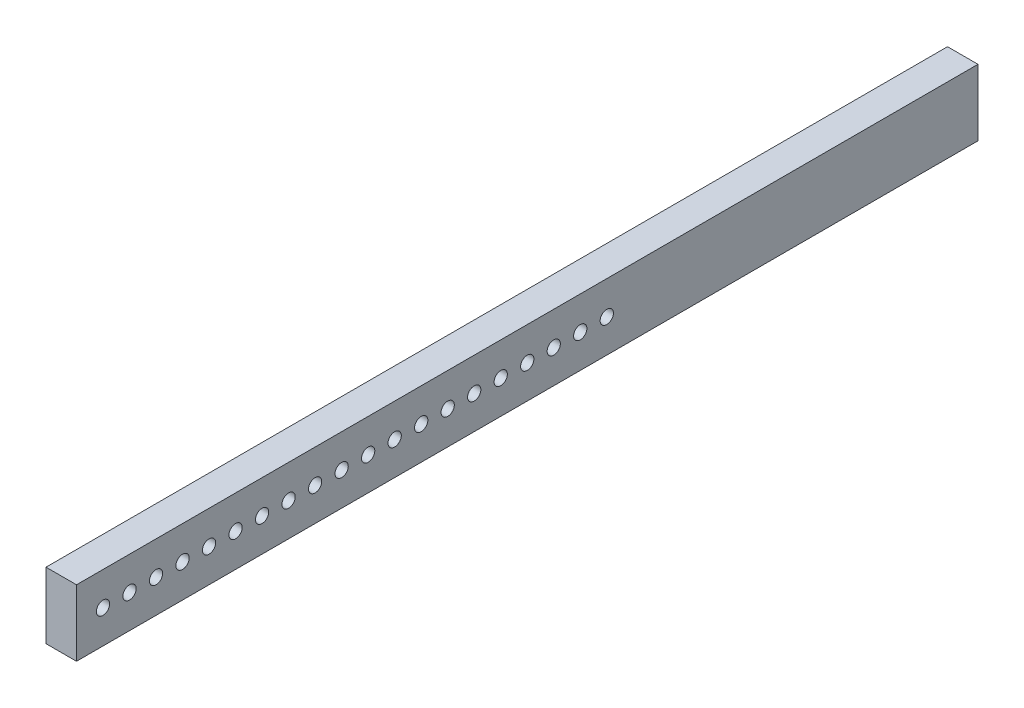
ISO-10303-21;
HEADER;
FILE_DESCRIPTION(('STEP AP214'),'2;1');
FILE_NAME('part.step','',(''),(''),'','','');
FILE_SCHEMA(('AUTOMOTIVE_DESIGN { 1 0 10303 214 1 1 1 1 }'));
ENDSEC;
DATA;
#1=APPLICATION_CONTEXT('core data for automotive mechanical design processes');
#2=APPLICATION_PROTOCOL_DEFINITION('international standard','automotive_design',2000,#1);
#3=PRODUCT_CONTEXT('',#1,'mechanical');
#4=PRODUCT('Part','Part','',(#3));
#5=PRODUCT_RELATED_PRODUCT_CATEGORY('part','',(#4));
#6=PRODUCT_DEFINITION_FORMATION('','',#4);
#7=PRODUCT_DEFINITION_CONTEXT('part definition',#1,'design');
#8=PRODUCT_DEFINITION('design','',#6,#7);
#9=PRODUCT_DEFINITION_SHAPE('','',#8);
#10=(LENGTH_UNIT() NAMED_UNIT(*) SI_UNIT(.MILLI.,.METRE.));
#11=(NAMED_UNIT(*) PLANE_ANGLE_UNIT() SI_UNIT($,.RADIAN.));
#12=(NAMED_UNIT(*) SI_UNIT($,.STERADIAN.) SOLID_ANGLE_UNIT());
#13=UNCERTAINTY_MEASURE_WITH_UNIT(LENGTH_MEASURE(1.E-05),#10,'distance_accuracy_value','');
#14=(GEOMETRIC_REPRESENTATION_CONTEXT(3) GLOBAL_UNCERTAINTY_ASSIGNED_CONTEXT((#13)) GLOBAL_UNIT_ASSIGNED_CONTEXT((#10,
#11,#12)) REPRESENTATION_CONTEXT('',''));
#15=CARTESIAN_POINT('',(0.,0.,0.));
#16=DIRECTION('',(0.,0.,1.));
#17=DIRECTION('',(1.,0.,0.));
#18=AXIS2_PLACEMENT_3D('',#15,#16,#17);
#19=CARTESIAN_POINT('',(23.,0.,0.));
#20=DIRECTION('',(1.,0.,0.));
#21=DIRECTION('',(0.,0.,-1.));
#22=AXIS2_PLACEMENT_3D('',#19,#20,#21);
#23=PLANE('',#22);
#24=CARTESIAN_POINT('',(23.,0.,-39.9999999999996));
#25=DIRECTION('',(1.,0.,0.));
#26=DIRECTION('',(0.,0.,-1.));
#27=AXIS2_PLACEMENT_3D('',#24,#25,#26);
#28=CIRCLE('',#27,4.99999999999999);
#29=CARTESIAN_POINT('',(23.,0.,-44.9999999999996));
#30=VERTEX_POINT('',#29);
#31=EDGE_CURVE('E218',#30,#30,#28,.T.);
#32=ORIENTED_EDGE('',*,*,#31,.F.);
#33=EDGE_LOOP('',(#32));
#34=FACE_BOUND('',#33,.T.);
#35=CARTESIAN_POINT('',(23.,0.,3.88578058618805E-13));
#36=DIRECTION('',(1.,0.,0.));
#37=DIRECTION('',(0.,0.,-1.));
#38=AXIS2_PLACEMENT_3D('',#35,#36,#37);
#39=CIRCLE('',#38,4.99999999999999);
#40=CARTESIAN_POINT('',(23.,0.,-4.9999999999996));
#41=VERTEX_POINT('',#40);
#42=EDGE_CURVE('E206',#41,#41,#39,.T.);
#43=ORIENTED_EDGE('',*,*,#42,.F.);
#44=EDGE_LOOP('',(#43));
#45=FACE_BOUND('',#44,.T.);
#46=CARTESIAN_POINT('',(23.,0.,40.0000000000004));
#47=DIRECTION('',(1.,0.,0.));
#48=DIRECTION('',(0.,0.,-1.));
#49=AXIS2_PLACEMENT_3D('',#46,#47,#48);
#50=CIRCLE('',#49,4.99999999999999);
#51=CARTESIAN_POINT('',(23.,0.,35.0000000000004));
#52=VERTEX_POINT('',#51);
#53=EDGE_CURVE('E194',#52,#52,#50,.T.);
#54=ORIENTED_EDGE('',*,*,#53,.F.);
#55=EDGE_LOOP('',(#54));
#56=FACE_BOUND('',#55,.T.);
#57=CARTESIAN_POINT('',(23.,0.,80.0000000000004));
#58=DIRECTION('',(1.,0.,0.));
#59=DIRECTION('',(0.,0.,-1.));
#60=AXIS2_PLACEMENT_3D('',#57,#58,#59);
#61=CIRCLE('',#60,4.99999999999999);
#62=CARTESIAN_POINT('',(23.,0.,75.0000000000004));
#63=VERTEX_POINT('',#62);
#64=EDGE_CURVE('E182',#63,#63,#61,.T.);
#65=ORIENTED_EDGE('',*,*,#64,.F.);
#66=EDGE_LOOP('',(#65));
#67=FACE_BOUND('',#66,.T.);
#68=CARTESIAN_POINT('',(23.,0.,120.));
#69=DIRECTION('',(1.,0.,0.));
#70=DIRECTION('',(0.,0.,-1.));
#71=AXIS2_PLACEMENT_3D('',#68,#69,#70);
#72=CIRCLE('',#71,4.99999999999999);
#73=CARTESIAN_POINT('',(23.,0.,115.));
#74=VERTEX_POINT('',#73);
#75=EDGE_CURVE('E170',#74,#74,#72,.T.);
#76=ORIENTED_EDGE('',*,*,#75,.F.);
#77=EDGE_LOOP('',(#76));
#78=FACE_BOUND('',#77,.T.);
#79=CARTESIAN_POINT('',(23.,0.,160.));
#80=DIRECTION('',(1.,0.,0.));
#81=DIRECTION('',(0.,0.,-1.));
#82=AXIS2_PLACEMENT_3D('',#79,#80,#81);
#83=CIRCLE('',#82,4.99999999999999);
#84=CARTESIAN_POINT('',(23.,0.,155.));
#85=VERTEX_POINT('',#84);
#86=EDGE_CURVE('E158',#85,#85,#83,.T.);
#87=ORIENTED_EDGE('',*,*,#86,.F.);
#88=EDGE_LOOP('',(#87));
#89=FACE_BOUND('',#88,.T.);
#90=CARTESIAN_POINT('',(23.,0.,200.));
#91=DIRECTION('',(1.,0.,0.));
#92=DIRECTION('',(0.,0.,-1.));
#93=AXIS2_PLACEMENT_3D('',#90,#91,#92);
#94=CIRCLE('',#93,4.99999999999999);
#95=CARTESIAN_POINT('',(23.,0.,195.));
#96=VERTEX_POINT('',#95);
#97=EDGE_CURVE('E146',#96,#96,#94,.T.);
#98=ORIENTED_EDGE('',*,*,#97,.F.);
#99=EDGE_LOOP('',(#98));
#100=FACE_BOUND('',#99,.T.);
#101=CARTESIAN_POINT('',(23.,0.,240.));
#102=DIRECTION('',(1.,0.,0.));
#103=DIRECTION('',(0.,0.,-1.));
#104=AXIS2_PLACEMENT_3D('',#101,#102,#103);
#105=CIRCLE('',#104,4.99999999999999);
#106=CARTESIAN_POINT('',(23.,0.,235.));
#107=VERTEX_POINT('',#106);
#108=EDGE_CURVE('E134',#107,#107,#105,.T.);
#109=ORIENTED_EDGE('',*,*,#108,.F.);
#110=EDGE_LOOP('',(#109));
#111=FACE_BOUND('',#110,.T.);
#112=CARTESIAN_POINT('',(23.,0.,280.));
#113=DIRECTION('',(1.,0.,0.));
#114=DIRECTION('',(0.,0.,-1.));
#115=AXIS2_PLACEMENT_3D('',#112,#113,#114);
#116=CIRCLE('',#115,4.99999999999999);
#117=CARTESIAN_POINT('',(23.,0.,275.));
#118=VERTEX_POINT('',#117);
#119=EDGE_CURVE('E122',#118,#118,#116,.T.);
#120=ORIENTED_EDGE('',*,*,#119,.F.);
#121=EDGE_LOOP('',(#120));
#122=FACE_BOUND('',#121,.T.);
#123=CARTESIAN_POINT('',(23.,0.,320.));
#124=DIRECTION('',(1.,0.,0.));
#125=DIRECTION('',(0.,0.,-1.));
#126=AXIS2_PLACEMENT_3D('',#123,#124,#125);
#127=CIRCLE('',#126,4.99999999999999);
#128=CARTESIAN_POINT('',(23.,0.,315.));
#129=VERTEX_POINT('',#128);
#130=EDGE_CURVE('E101',#129,#129,#127,.T.);
#131=ORIENTED_EDGE('',*,*,#130,.F.);
#132=EDGE_LOOP('',(#131));
#133=FACE_BOUND('',#132,.T.);
#134=DIRECTION('',(0.,1.,0.));
#135=VECTOR('',#134,1.);
#136=CARTESIAN_POINT('',(23.,25.,-340.));
#137=LINE('',#136,#135);
#138=CARTESIAN_POINT('',(23.,-25.,-340.));
#139=VERTEX_POINT('',#138);
#140=CARTESIAN_POINT('',(23.,25.,-340.));
#141=VERTEX_POINT('',#140);
#142=EDGE_CURVE('E86',#139,#141,#137,.T.);
#143=ORIENTED_EDGE('',*,*,#142,.T.);
#144=DIRECTION('',(0.,0.,1.));
#145=VECTOR('',#144,1.);
#146=CARTESIAN_POINT('',(23.,25.,340.));
#147=LINE('',#146,#145);
#148=CARTESIAN_POINT('',(23.,25.,340.));
#149=VERTEX_POINT('',#148);
#150=EDGE_CURVE('E81',#141,#149,#147,.T.);
#151=ORIENTED_EDGE('',*,*,#150,.T.);
#152=DIRECTION('',(0.,-1.,0.));
#153=VECTOR('',#152,1.);
#154=CARTESIAN_POINT('',(23.,25.,340.));
#155=LINE('',#154,#153);
#156=CARTESIAN_POINT('',(23.,-25.,340.));
#157=VERTEX_POINT('',#156);
#158=EDGE_CURVE('E84',#149,#157,#155,.T.);
#159=ORIENTED_EDGE('',*,*,#158,.T.);
#160=DIRECTION('',(0.,0.,-1.));
#161=VECTOR('',#160,1.);
#162=CARTESIAN_POINT('',(23.,-25.,340.));
#163=LINE('',#162,#161);
#164=EDGE_CURVE('E51',#157,#139,#163,.T.);
#165=ORIENTED_EDGE('',*,*,#164,.T.);
#166=EDGE_LOOP('',(#143,#151,#159,#165));
#167=FACE_BOUND('',#166,.T.);
#168=CARTESIAN_POINT('',(23.,0.,300.));
#169=DIRECTION('',(1.,0.,0.));
#170=DIRECTION('',(0.,0.,-1.));
#171=AXIS2_PLACEMENT_3D('',#168,#169,#170);
#172=CIRCLE('',#171,4.99999999999999);
#173=CARTESIAN_POINT('',(23.,0.,295.));
#174=VERTEX_POINT('',#173);
#175=EDGE_CURVE('E116',#174,#174,#172,.T.);
#176=ORIENTED_EDGE('',*,*,#175,.F.);
#177=EDGE_LOOP('',(#176));
#178=FACE_BOUND('',#177,.T.);
#179=CARTESIAN_POINT('',(23.,0.,260.));
#180=DIRECTION('',(1.,0.,0.));
#181=DIRECTION('',(0.,0.,-1.));
#182=AXIS2_PLACEMENT_3D('',#179,#180,#181);
#183=CIRCLE('',#182,4.99999999999999);
#184=CARTESIAN_POINT('',(23.,0.,255.));
#185=VERTEX_POINT('',#184);
#186=EDGE_CURVE('E128',#185,#185,#183,.T.);
#187=ORIENTED_EDGE('',*,*,#186,.F.);
#188=EDGE_LOOP('',(#187));
#189=FACE_BOUND('',#188,.T.);
#190=CARTESIAN_POINT('',(23.,0.,220.));
#191=DIRECTION('',(1.,0.,0.));
#192=DIRECTION('',(0.,0.,-1.));
#193=AXIS2_PLACEMENT_3D('',#190,#191,#192);
#194=CIRCLE('',#193,4.99999999999999);
#195=CARTESIAN_POINT('',(23.,0.,215.));
#196=VERTEX_POINT('',#195);
#197=EDGE_CURVE('E140',#196,#196,#194,.T.);
#198=ORIENTED_EDGE('',*,*,#197,.F.);
#199=EDGE_LOOP('',(#198));
#200=FACE_BOUND('',#199,.T.);
#201=CARTESIAN_POINT('',(23.,0.,180.));
#202=DIRECTION('',(1.,0.,0.));
#203=DIRECTION('',(0.,0.,-1.));
#204=AXIS2_PLACEMENT_3D('',#201,#202,#203);
#205=CIRCLE('',#204,4.99999999999999);
#206=CARTESIAN_POINT('',(23.,0.,175.));
#207=VERTEX_POINT('',#206);
#208=EDGE_CURVE('E152',#207,#207,#205,.T.);
#209=ORIENTED_EDGE('',*,*,#208,.F.);
#210=EDGE_LOOP('',(#209));
#211=FACE_BOUND('',#210,.T.);
#212=CARTESIAN_POINT('',(23.,0.,140.));
#213=DIRECTION('',(1.,0.,0.));
#214=DIRECTION('',(0.,0.,-1.));
#215=AXIS2_PLACEMENT_3D('',#212,#213,#214);
#216=CIRCLE('',#215,4.99999999999999);
#217=CARTESIAN_POINT('',(23.,0.,135.));
#218=VERTEX_POINT('',#217);
#219=EDGE_CURVE('E164',#218,#218,#216,.T.);
#220=ORIENTED_EDGE('',*,*,#219,.F.);
#221=EDGE_LOOP('',(#220));
#222=FACE_BOUND('',#221,.T.);
#223=CARTESIAN_POINT('',(23.,0.,100.));
#224=DIRECTION('',(1.,0.,0.));
#225=DIRECTION('',(0.,0.,-1.));
#226=AXIS2_PLACEMENT_3D('',#223,#224,#225);
#227=CIRCLE('',#226,4.99999999999999);
#228=CARTESIAN_POINT('',(23.,0.,95.0000000000004));
#229=VERTEX_POINT('',#228);
#230=EDGE_CURVE('E176',#229,#229,#227,.T.);
#231=ORIENTED_EDGE('',*,*,#230,.F.);
#232=EDGE_LOOP('',(#231));
#233=FACE_BOUND('',#232,.T.);
#234=CARTESIAN_POINT('',(23.,0.,60.0000000000004));
#235=DIRECTION('',(1.,0.,0.));
#236=DIRECTION('',(0.,0.,-1.));
#237=AXIS2_PLACEMENT_3D('',#234,#235,#236);
#238=CIRCLE('',#237,4.99999999999999);
#239=CARTESIAN_POINT('',(23.,0.,55.0000000000004));
#240=VERTEX_POINT('',#239);
#241=EDGE_CURVE('E188',#240,#240,#238,.T.);
#242=ORIENTED_EDGE('',*,*,#241,.F.);
#243=EDGE_LOOP('',(#242));
#244=FACE_BOUND('',#243,.T.);
#245=CARTESIAN_POINT('',(23.,0.,20.0000000000004));
#246=DIRECTION('',(1.,0.,0.));
#247=DIRECTION('',(0.,0.,-1.));
#248=AXIS2_PLACEMENT_3D('',#245,#246,#247);
#249=CIRCLE('',#248,4.99999999999999);
#250=CARTESIAN_POINT('',(23.,0.,15.0000000000004));
#251=VERTEX_POINT('',#250);
#252=EDGE_CURVE('E200',#251,#251,#249,.T.);
#253=ORIENTED_EDGE('',*,*,#252,.F.);
#254=EDGE_LOOP('',(#253));
#255=FACE_BOUND('',#254,.T.);
#256=CARTESIAN_POINT('',(23.,0.,-19.9999999999996));
#257=DIRECTION('',(1.,0.,0.));
#258=DIRECTION('',(0.,0.,-1.));
#259=AXIS2_PLACEMENT_3D('',#256,#257,#258);
#260=CIRCLE('',#259,4.99999999999999);
#261=CARTESIAN_POINT('',(23.,0.,-24.9999999999996));
#262=VERTEX_POINT('',#261);
#263=EDGE_CURVE('E212',#262,#262,#260,.T.);
#264=ORIENTED_EDGE('',*,*,#263,.F.);
#265=EDGE_LOOP('',(#264));
#266=FACE_BOUND('',#265,.T.);
#267=CARTESIAN_POINT('',(23.,0.,-59.9999999999996));
#268=DIRECTION('',(1.,0.,0.));
#269=DIRECTION('',(0.,0.,-1.));
#270=AXIS2_PLACEMENT_3D('',#267,#268,#269);
#271=CIRCLE('',#270,4.99999999999999);
#272=CARTESIAN_POINT('',(23.,0.,-64.9999999999996));
#273=VERTEX_POINT('',#272);
#274=EDGE_CURVE('E224',#273,#273,#271,.T.);
#275=ORIENTED_EDGE('',*,*,#274,.F.);
#276=EDGE_LOOP('',(#275));
#277=FACE_BOUND('',#276,.T.);
#278=ADVANCED_FACE('F34',(#34,#45,#56,#67,#78,#89,#100,#111,#122,#133,#167,#178,#189,#200,#211,
#222,#233,#244,#255,#266,#277),#23,.T.);
#279=CARTESIAN_POINT('',(0.,0.,0.));
#280=DIRECTION('',(1.,0.,0.));
#281=DIRECTION('',(0.,0.,-1.));
#282=AXIS2_PLACEMENT_3D('',#279,#280,#281);
#283=PLANE('',#282);
#284=CARTESIAN_POINT('',(0.,0.,-39.9999999999996));
#285=DIRECTION('',(1.,0.,0.));
#286=DIRECTION('',(0.,0.,-1.));
#287=AXIS2_PLACEMENT_3D('',#284,#285,#286);
#288=CIRCLE('',#287,4.99999999999999);
#289=CARTESIAN_POINT('',(0.,0.,-44.9999999999996));
#290=VERTEX_POINT('',#289);
#291=EDGE_CURVE('E221',#290,#290,#288,.T.);
#292=ORIENTED_EDGE('',*,*,#291,.T.);
#293=EDGE_LOOP('',(#292));
#294=FACE_BOUND('',#293,.T.);
#295=CARTESIAN_POINT('',(0.,0.,3.88578058618805E-13));
#296=DIRECTION('',(1.,0.,0.));
#297=DIRECTION('',(0.,0.,-1.));
#298=AXIS2_PLACEMENT_3D('',#295,#296,#297);
#299=CIRCLE('',#298,4.99999999999999);
#300=CARTESIAN_POINT('',(0.,0.,-4.9999999999996));
#301=VERTEX_POINT('',#300);
#302=EDGE_CURVE('E209',#301,#301,#299,.T.);
#303=ORIENTED_EDGE('',*,*,#302,.T.);
#304=EDGE_LOOP('',(#303));
#305=FACE_BOUND('',#304,.T.);
#306=CARTESIAN_POINT('',(0.,0.,40.0000000000004));
#307=DIRECTION('',(1.,0.,0.));
#308=DIRECTION('',(0.,0.,-1.));
#309=AXIS2_PLACEMENT_3D('',#306,#307,#308);
#310=CIRCLE('',#309,4.99999999999999);
#311=CARTESIAN_POINT('',(0.,0.,35.0000000000004));
#312=VERTEX_POINT('',#311);
#313=EDGE_CURVE('E197',#312,#312,#310,.T.);
#314=ORIENTED_EDGE('',*,*,#313,.T.);
#315=EDGE_LOOP('',(#314));
#316=FACE_BOUND('',#315,.T.);
#317=CARTESIAN_POINT('',(0.,0.,80.0000000000004));
#318=DIRECTION('',(1.,0.,0.));
#319=DIRECTION('',(0.,0.,-1.));
#320=AXIS2_PLACEMENT_3D('',#317,#318,#319);
#321=CIRCLE('',#320,4.99999999999999);
#322=CARTESIAN_POINT('',(0.,0.,75.0000000000004));
#323=VERTEX_POINT('',#322);
#324=EDGE_CURVE('E185',#323,#323,#321,.T.);
#325=ORIENTED_EDGE('',*,*,#324,.T.);
#326=EDGE_LOOP('',(#325));
#327=FACE_BOUND('',#326,.T.);
#328=CARTESIAN_POINT('',(0.,0.,120.));
#329=DIRECTION('',(1.,0.,0.));
#330=DIRECTION('',(0.,0.,-1.));
#331=AXIS2_PLACEMENT_3D('',#328,#329,#330);
#332=CIRCLE('',#331,4.99999999999999);
#333=CARTESIAN_POINT('',(0.,0.,115.));
#334=VERTEX_POINT('',#333);
#335=EDGE_CURVE('E173',#334,#334,#332,.T.);
#336=ORIENTED_EDGE('',*,*,#335,.T.);
#337=EDGE_LOOP('',(#336));
#338=FACE_BOUND('',#337,.T.);
#339=CARTESIAN_POINT('',(0.,0.,160.));
#340=DIRECTION('',(1.,0.,0.));
#341=DIRECTION('',(0.,0.,-1.));
#342=AXIS2_PLACEMENT_3D('',#339,#340,#341);
#343=CIRCLE('',#342,4.99999999999999);
#344=CARTESIAN_POINT('',(0.,0.,155.));
#345=VERTEX_POINT('',#344);
#346=EDGE_CURVE('E161',#345,#345,#343,.T.);
#347=ORIENTED_EDGE('',*,*,#346,.T.);
#348=EDGE_LOOP('',(#347));
#349=FACE_BOUND('',#348,.T.);
#350=CARTESIAN_POINT('',(0.,0.,200.));
#351=DIRECTION('',(1.,0.,0.));
#352=DIRECTION('',(0.,0.,-1.));
#353=AXIS2_PLACEMENT_3D('',#350,#351,#352);
#354=CIRCLE('',#353,4.99999999999999);
#355=CARTESIAN_POINT('',(0.,0.,195.));
#356=VERTEX_POINT('',#355);
#357=EDGE_CURVE('E149',#356,#356,#354,.T.);
#358=ORIENTED_EDGE('',*,*,#357,.T.);
#359=EDGE_LOOP('',(#358));
#360=FACE_BOUND('',#359,.T.);
#361=CARTESIAN_POINT('',(0.,0.,240.));
#362=DIRECTION('',(1.,0.,0.));
#363=DIRECTION('',(0.,0.,-1.));
#364=AXIS2_PLACEMENT_3D('',#361,#362,#363);
#365=CIRCLE('',#364,4.99999999999999);
#366=CARTESIAN_POINT('',(0.,0.,235.));
#367=VERTEX_POINT('',#366);
#368=EDGE_CURVE('E137',#367,#367,#365,.T.);
#369=ORIENTED_EDGE('',*,*,#368,.T.);
#370=EDGE_LOOP('',(#369));
#371=FACE_BOUND('',#370,.T.);
#372=CARTESIAN_POINT('',(0.,0.,280.));
#373=DIRECTION('',(1.,0.,0.));
#374=DIRECTION('',(0.,0.,-1.));
#375=AXIS2_PLACEMENT_3D('',#372,#373,#374);
#376=CIRCLE('',#375,4.99999999999999);
#377=CARTESIAN_POINT('',(0.,0.,275.));
#378=VERTEX_POINT('',#377);
#379=EDGE_CURVE('E125',#378,#378,#376,.T.);
#380=ORIENTED_EDGE('',*,*,#379,.T.);
#381=EDGE_LOOP('',(#380));
#382=FACE_BOUND('',#381,.T.);
#383=CARTESIAN_POINT('',(0.,0.,320.));
#384=DIRECTION('',(1.,0.,0.));
#385=DIRECTION('',(0.,0.,-1.));
#386=AXIS2_PLACEMENT_3D('',#383,#384,#385);
#387=CIRCLE('',#386,4.99999999999999);
#388=CARTESIAN_POINT('',(0.,0.,315.));
#389=VERTEX_POINT('',#388);
#390=EDGE_CURVE('E113',#389,#389,#387,.T.);
#391=ORIENTED_EDGE('',*,*,#390,.T.);
#392=EDGE_LOOP('',(#391));
#393=FACE_BOUND('',#392,.T.);
#394=DIRECTION('',(0.,1.,0.));
#395=VECTOR('',#394,1.);
#396=CARTESIAN_POINT('',(0.,25.,-340.));
#397=LINE('',#396,#395);
#398=CARTESIAN_POINT('',(0.,-25.,-340.));
#399=VERTEX_POINT('',#398);
#400=CARTESIAN_POINT('',(0.,25.,-340.));
#401=VERTEX_POINT('',#400);
#402=EDGE_CURVE('E98',#399,#401,#397,.T.);
#403=ORIENTED_EDGE('',*,*,#402,.F.);
#404=DIRECTION('',(0.,0.,-1.));
#405=VECTOR('',#404,1.);
#406=CARTESIAN_POINT('',(0.,-25.,340.));
#407=LINE('',#406,#405);
#408=CARTESIAN_POINT('',(0.,-25.,340.));
#409=VERTEX_POINT('',#408);
#410=EDGE_CURVE('E74',#409,#399,#407,.T.);
#411=ORIENTED_EDGE('',*,*,#410,.F.);
#412=DIRECTION('',(0.,-1.,0.));
#413=VECTOR('',#412,1.);
#414=CARTESIAN_POINT('',(0.,25.,340.));
#415=LINE('',#414,#413);
#416=CARTESIAN_POINT('',(0.,25.,340.));
#417=VERTEX_POINT('',#416);
#418=EDGE_CURVE('E68',#417,#409,#415,.T.);
#419=ORIENTED_EDGE('',*,*,#418,.F.);
#420=DIRECTION('',(0.,0.,1.));
#421=VECTOR('',#420,1.);
#422=CARTESIAN_POINT('',(0.,25.,340.));
#423=LINE('',#422,#421);
#424=EDGE_CURVE('E90',#401,#417,#423,.T.);
#425=ORIENTED_EDGE('',*,*,#424,.F.);
#426=EDGE_LOOP('',(#403,#411,#419,#425));
#427=FACE_BOUND('',#426,.T.);
#428=CARTESIAN_POINT('',(0.,0.,300.));
#429=DIRECTION('',(1.,0.,0.));
#430=DIRECTION('',(0.,0.,-1.));
#431=AXIS2_PLACEMENT_3D('',#428,#429,#430);
#432=CIRCLE('',#431,4.99999999999999);
#433=CARTESIAN_POINT('',(0.,0.,295.));
#434=VERTEX_POINT('',#433);
#435=EDGE_CURVE('E119',#434,#434,#432,.T.);
#436=ORIENTED_EDGE('',*,*,#435,.T.);
#437=EDGE_LOOP('',(#436));
#438=FACE_BOUND('',#437,.T.);
#439=CARTESIAN_POINT('',(0.,0.,260.));
#440=DIRECTION('',(1.,0.,0.));
#441=DIRECTION('',(0.,0.,-1.));
#442=AXIS2_PLACEMENT_3D('',#439,#440,#441);
#443=CIRCLE('',#442,4.99999999999999);
#444=CARTESIAN_POINT('',(0.,0.,255.));
#445=VERTEX_POINT('',#444);
#446=EDGE_CURVE('E131',#445,#445,#443,.T.);
#447=ORIENTED_EDGE('',*,*,#446,.T.);
#448=EDGE_LOOP('',(#447));
#449=FACE_BOUND('',#448,.T.);
#450=CARTESIAN_POINT('',(0.,0.,220.));
#451=DIRECTION('',(1.,0.,0.));
#452=DIRECTION('',(0.,0.,-1.));
#453=AXIS2_PLACEMENT_3D('',#450,#451,#452);
#454=CIRCLE('',#453,4.99999999999999);
#455=CARTESIAN_POINT('',(0.,0.,215.));
#456=VERTEX_POINT('',#455);
#457=EDGE_CURVE('E143',#456,#456,#454,.T.);
#458=ORIENTED_EDGE('',*,*,#457,.T.);
#459=EDGE_LOOP('',(#458));
#460=FACE_BOUND('',#459,.T.);
#461=CARTESIAN_POINT('',(0.,0.,180.));
#462=DIRECTION('',(1.,0.,0.));
#463=DIRECTION('',(0.,0.,-1.));
#464=AXIS2_PLACEMENT_3D('',#461,#462,#463);
#465=CIRCLE('',#464,4.99999999999999);
#466=CARTESIAN_POINT('',(0.,0.,175.));
#467=VERTEX_POINT('',#466);
#468=EDGE_CURVE('E155',#467,#467,#465,.T.);
#469=ORIENTED_EDGE('',*,*,#468,.T.);
#470=EDGE_LOOP('',(#469));
#471=FACE_BOUND('',#470,.T.);
#472=CARTESIAN_POINT('',(0.,0.,140.));
#473=DIRECTION('',(1.,0.,0.));
#474=DIRECTION('',(0.,0.,-1.));
#475=AXIS2_PLACEMENT_3D('',#472,#473,#474);
#476=CIRCLE('',#475,4.99999999999999);
#477=CARTESIAN_POINT('',(0.,0.,135.));
#478=VERTEX_POINT('',#477);
#479=EDGE_CURVE('E167',#478,#478,#476,.T.);
#480=ORIENTED_EDGE('',*,*,#479,.T.);
#481=EDGE_LOOP('',(#480));
#482=FACE_BOUND('',#481,.T.);
#483=CARTESIAN_POINT('',(0.,0.,100.));
#484=DIRECTION('',(1.,0.,0.));
#485=DIRECTION('',(0.,0.,-1.));
#486=AXIS2_PLACEMENT_3D('',#483,#484,#485);
#487=CIRCLE('',#486,4.99999999999999);
#488=CARTESIAN_POINT('',(0.,0.,95.0000000000004));
#489=VERTEX_POINT('',#488);
#490=EDGE_CURVE('E179',#489,#489,#487,.T.);
#491=ORIENTED_EDGE('',*,*,#490,.T.);
#492=EDGE_LOOP('',(#491));
#493=FACE_BOUND('',#492,.T.);
#494=CARTESIAN_POINT('',(0.,0.,60.0000000000004));
#495=DIRECTION('',(1.,0.,0.));
#496=DIRECTION('',(0.,0.,-1.));
#497=AXIS2_PLACEMENT_3D('',#494,#495,#496);
#498=CIRCLE('',#497,4.99999999999999);
#499=CARTESIAN_POINT('',(0.,0.,55.0000000000004));
#500=VERTEX_POINT('',#499);
#501=EDGE_CURVE('E191',#500,#500,#498,.T.);
#502=ORIENTED_EDGE('',*,*,#501,.T.);
#503=EDGE_LOOP('',(#502));
#504=FACE_BOUND('',#503,.T.);
#505=CARTESIAN_POINT('',(0.,0.,20.0000000000004));
#506=DIRECTION('',(1.,0.,0.));
#507=DIRECTION('',(0.,0.,-1.));
#508=AXIS2_PLACEMENT_3D('',#505,#506,#507);
#509=CIRCLE('',#508,4.99999999999999);
#510=CARTESIAN_POINT('',(0.,0.,15.0000000000004));
#511=VERTEX_POINT('',#510);
#512=EDGE_CURVE('E203',#511,#511,#509,.T.);
#513=ORIENTED_EDGE('',*,*,#512,.T.);
#514=EDGE_LOOP('',(#513));
#515=FACE_BOUND('',#514,.T.);
#516=CARTESIAN_POINT('',(0.,0.,-19.9999999999996));
#517=DIRECTION('',(1.,0.,0.));
#518=DIRECTION('',(0.,0.,-1.));
#519=AXIS2_PLACEMENT_3D('',#516,#517,#518);
#520=CIRCLE('',#519,4.99999999999999);
#521=CARTESIAN_POINT('',(0.,0.,-24.9999999999996));
#522=VERTEX_POINT('',#521);
#523=EDGE_CURVE('E215',#522,#522,#520,.T.);
#524=ORIENTED_EDGE('',*,*,#523,.T.);
#525=EDGE_LOOP('',(#524));
#526=FACE_BOUND('',#525,.T.);
#527=CARTESIAN_POINT('',(0.,0.,-59.9999999999996));
#528=DIRECTION('',(1.,0.,0.));
#529=DIRECTION('',(0.,0.,-1.));
#530=AXIS2_PLACEMENT_3D('',#527,#528,#529);
#531=CIRCLE('',#530,4.99999999999999);
#532=CARTESIAN_POINT('',(0.,0.,-64.9999999999996));
#533=VERTEX_POINT('',#532);
#534=EDGE_CURVE('E227',#533,#533,#531,.T.);
#535=ORIENTED_EDGE('',*,*,#534,.T.);
#536=EDGE_LOOP('',(#535));
#537=FACE_BOUND('',#536,.T.);
#538=ADVANCED_FACE('F109',(#294,#305,#316,#327,#338,#349,#360,#371,#382,#393,#427,#438,#449,
#460,#471,#482,#493,#504,#515,#526,#537),#283,.F.);
#539=CARTESIAN_POINT('',(23.,25.,-340.));
#540=DIRECTION('',(0.,0.,1.));
#541=DIRECTION('',(1.,0.,0.));
#542=AXIS2_PLACEMENT_3D('',#539,#540,#541);
#543=PLANE('',#542);
#544=ORIENTED_EDGE('',*,*,#402,.T.);
#545=DIRECTION('',(-1.,0.,0.));
#546=VECTOR('',#545,1.);
#547=CARTESIAN_POINT('',(23.,25.,-340.));
#548=LINE('',#547,#546);
#549=EDGE_CURVE('E11',#141,#401,#548,.T.);
#550=ORIENTED_EDGE('',*,*,#549,.F.);
#551=ORIENTED_EDGE('',*,*,#142,.F.);
#552=DIRECTION('',(-1.,0.,0.));
#553=VECTOR('',#552,1.);
#554=CARTESIAN_POINT('',(23.,-25.,-340.));
#555=LINE('',#554,#553);
#556=EDGE_CURVE('E94',#139,#399,#555,.T.);
#557=ORIENTED_EDGE('',*,*,#556,.T.);
#558=EDGE_LOOP('',(#544,#550,#551,#557));
#559=FACE_BOUND('',#558,.T.);
#560=ADVANCED_FACE('F36',(#559),#543,.F.);
#561=CARTESIAN_POINT('',(23.,25.,340.));
#562=DIRECTION('',(0.,-1.,0.));
#563=DIRECTION('',(0.,0.,-1.));
#564=AXIS2_PLACEMENT_3D('',#561,#562,#563);
#565=PLANE('',#564);
#566=ORIENTED_EDGE('',*,*,#424,.T.);
#567=DIRECTION('',(-1.,0.,0.));
#568=VECTOR('',#567,1.);
#569=CARTESIAN_POINT('',(23.,25.,340.));
#570=LINE('',#569,#568);
#571=EDGE_CURVE('E43',#149,#417,#570,.T.);
#572=ORIENTED_EDGE('',*,*,#571,.F.);
#573=ORIENTED_EDGE('',*,*,#150,.F.);
#574=ORIENTED_EDGE('',*,*,#549,.T.);
#575=EDGE_LOOP('',(#566,#572,#573,#574));
#576=FACE_BOUND('',#575,.T.);
#577=ADVANCED_FACE('F89',(#576),#565,.F.);
#578=CARTESIAN_POINT('',(23.,25.,340.));
#579=DIRECTION('',(0.,0.,-1.));
#580=DIRECTION('',(-1.,0.,0.));
#581=AXIS2_PLACEMENT_3D('',#578,#579,#580);
#582=PLANE('',#581);
#583=ORIENTED_EDGE('',*,*,#418,.T.);
#584=DIRECTION('',(-1.,0.,0.));
#585=VECTOR('',#584,1.);
#586=CARTESIAN_POINT('',(23.,-25.,340.));
#587=LINE('',#586,#585);
#588=EDGE_CURVE('E91',#157,#409,#587,.T.);
#589=ORIENTED_EDGE('',*,*,#588,.F.);
#590=ORIENTED_EDGE('',*,*,#158,.F.);
#591=ORIENTED_EDGE('',*,*,#571,.T.);
#592=EDGE_LOOP('',(#583,#589,#590,#591));
#593=FACE_BOUND('',#592,.T.);
#594=ADVANCED_FACE('F92',(#593),#582,.F.);
#595=CARTESIAN_POINT('',(23.,-25.,340.));
#596=DIRECTION('',(0.,1.,0.));
#597=DIRECTION('',(0.,0.,1.));
#598=AXIS2_PLACEMENT_3D('',#595,#596,#597);
#599=PLANE('',#598);
#600=ORIENTED_EDGE('',*,*,#410,.T.);
#601=ORIENTED_EDGE('',*,*,#556,.F.);
#602=ORIENTED_EDGE('',*,*,#164,.F.);
#603=ORIENTED_EDGE('',*,*,#588,.T.);
#604=EDGE_LOOP('',(#600,#601,#602,#603));
#605=FACE_BOUND('',#604,.T.);
#606=ADVANCED_FACE('F106',(#605),#599,.F.);
#607=CARTESIAN_POINT('',(23.,0.,320.));
#608=DIRECTION('',(-1.,0.,0.));
#609=DIRECTION('',(0.,0.,1.));
#610=AXIS2_PLACEMENT_3D('',#607,#608,#609);
#611=CYLINDRICAL_SURFACE('',#610,4.99999999999999);
#612=ORIENTED_EDGE('',*,*,#130,.T.);
#613=EDGE_LOOP('',(#612));
#614=FACE_BOUND('',#613,.T.);
#615=ORIENTED_EDGE('',*,*,#390,.F.);
#616=EDGE_LOOP('',(#615));
#617=FACE_BOUND('',#616,.T.);
#618=ADVANCED_FACE('F247',(#614,#617),#611,.F.);
#619=CARTESIAN_POINT('',(23.,0.,300.));
#620=DIRECTION('',(-1.,0.,0.));
#621=DIRECTION('',(0.,0.,1.));
#622=AXIS2_PLACEMENT_3D('',#619,#620,#621);
#623=CYLINDRICAL_SURFACE('',#622,4.99999999999999);
#624=ORIENTED_EDGE('',*,*,#175,.T.);
#625=EDGE_LOOP('',(#624));
#626=FACE_BOUND('',#625,.T.);
#627=ORIENTED_EDGE('',*,*,#435,.F.);
#628=EDGE_LOOP('',(#627));
#629=FACE_BOUND('',#628,.T.);
#630=ADVANCED_FACE('F293',(#626,#629),#623,.F.);
#631=CARTESIAN_POINT('',(23.,0.,280.));
#632=DIRECTION('',(-1.,0.,0.));
#633=DIRECTION('',(0.,0.,1.));
#634=AXIS2_PLACEMENT_3D('',#631,#632,#633);
#635=CYLINDRICAL_SURFACE('',#634,4.99999999999999);
#636=ORIENTED_EDGE('',*,*,#119,.T.);
#637=EDGE_LOOP('',(#636));
#638=FACE_BOUND('',#637,.T.);
#639=ORIENTED_EDGE('',*,*,#379,.F.);
#640=EDGE_LOOP('',(#639));
#641=FACE_BOUND('',#640,.T.);
#642=ADVANCED_FACE('F301',(#638,#641),#635,.F.);
#643=CARTESIAN_POINT('',(23.,0.,260.));
#644=DIRECTION('',(-1.,0.,0.));
#645=DIRECTION('',(0.,0.,1.));
#646=AXIS2_PLACEMENT_3D('',#643,#644,#645);
#647=CYLINDRICAL_SURFACE('',#646,4.99999999999999);
#648=ORIENTED_EDGE('',*,*,#186,.T.);
#649=EDGE_LOOP('',(#648));
#650=FACE_BOUND('',#649,.T.);
#651=ORIENTED_EDGE('',*,*,#446,.F.);
#652=EDGE_LOOP('',(#651));
#653=FACE_BOUND('',#652,.T.);
#654=ADVANCED_FACE('F309',(#650,#653),#647,.F.);
#655=CARTESIAN_POINT('',(23.,0.,240.));
#656=DIRECTION('',(-1.,0.,0.));
#657=DIRECTION('',(0.,0.,1.));
#658=AXIS2_PLACEMENT_3D('',#655,#656,#657);
#659=CYLINDRICAL_SURFACE('',#658,4.99999999999999);
#660=ORIENTED_EDGE('',*,*,#108,.T.);
#661=EDGE_LOOP('',(#660));
#662=FACE_BOUND('',#661,.T.);
#663=ORIENTED_EDGE('',*,*,#368,.F.);
#664=EDGE_LOOP('',(#663));
#665=FACE_BOUND('',#664,.T.);
#666=ADVANCED_FACE('F318',(#662,#665),#659,.F.);
#667=CARTESIAN_POINT('',(23.,0.,220.));
#668=DIRECTION('',(-1.,0.,0.));
#669=DIRECTION('',(0.,0.,1.));
#670=AXIS2_PLACEMENT_3D('',#667,#668,#669);
#671=CYLINDRICAL_SURFACE('',#670,4.99999999999999);
#672=ORIENTED_EDGE('',*,*,#197,.T.);
#673=EDGE_LOOP('',(#672));
#674=FACE_BOUND('',#673,.T.);
#675=ORIENTED_EDGE('',*,*,#457,.F.);
#676=EDGE_LOOP('',(#675));
#677=FACE_BOUND('',#676,.T.);
#678=ADVANCED_FACE('F327',(#674,#677),#671,.F.);
#679=CARTESIAN_POINT('',(23.,0.,200.));
#680=DIRECTION('',(-1.,0.,0.));
#681=DIRECTION('',(0.,0.,1.));
#682=AXIS2_PLACEMENT_3D('',#679,#680,#681);
#683=CYLINDRICAL_SURFACE('',#682,4.99999999999999);
#684=ORIENTED_EDGE('',*,*,#97,.T.);
#685=EDGE_LOOP('',(#684));
#686=FACE_BOUND('',#685,.T.);
#687=ORIENTED_EDGE('',*,*,#357,.F.);
#688=EDGE_LOOP('',(#687));
#689=FACE_BOUND('',#688,.T.);
#690=ADVANCED_FACE('F336',(#686,#689),#683,.F.);
#691=CARTESIAN_POINT('',(23.,0.,180.));
#692=DIRECTION('',(-1.,0.,0.));
#693=DIRECTION('',(0.,0.,1.));
#694=AXIS2_PLACEMENT_3D('',#691,#692,#693);
#695=CYLINDRICAL_SURFACE('',#694,4.99999999999999);
#696=ORIENTED_EDGE('',*,*,#208,.T.);
#697=EDGE_LOOP('',(#696));
#698=FACE_BOUND('',#697,.T.);
#699=ORIENTED_EDGE('',*,*,#468,.F.);
#700=EDGE_LOOP('',(#699));
#701=FACE_BOUND('',#700,.T.);
#702=ADVANCED_FACE('F345',(#698,#701),#695,.F.);
#703=CARTESIAN_POINT('',(23.,0.,160.));
#704=DIRECTION('',(-1.,0.,0.));
#705=DIRECTION('',(0.,0.,1.));
#706=AXIS2_PLACEMENT_3D('',#703,#704,#705);
#707=CYLINDRICAL_SURFACE('',#706,4.99999999999999);
#708=ORIENTED_EDGE('',*,*,#86,.T.);
#709=EDGE_LOOP('',(#708));
#710=FACE_BOUND('',#709,.T.);
#711=ORIENTED_EDGE('',*,*,#346,.F.);
#712=EDGE_LOOP('',(#711));
#713=FACE_BOUND('',#712,.T.);
#714=ADVANCED_FACE('F354',(#710,#713),#707,.F.);
#715=CARTESIAN_POINT('',(23.,0.,140.));
#716=DIRECTION('',(-1.,0.,0.));
#717=DIRECTION('',(0.,0.,1.));
#718=AXIS2_PLACEMENT_3D('',#715,#716,#717);
#719=CYLINDRICAL_SURFACE('',#718,4.99999999999999);
#720=ORIENTED_EDGE('',*,*,#219,.T.);
#721=EDGE_LOOP('',(#720));
#722=FACE_BOUND('',#721,.T.);
#723=ORIENTED_EDGE('',*,*,#479,.F.);
#724=EDGE_LOOP('',(#723));
#725=FACE_BOUND('',#724,.T.);
#726=ADVANCED_FACE('F363',(#722,#725),#719,.F.);
#727=CARTESIAN_POINT('',(23.,0.,120.));
#728=DIRECTION('',(-1.,0.,0.));
#729=DIRECTION('',(0.,0.,1.));
#730=AXIS2_PLACEMENT_3D('',#727,#728,#729);
#731=CYLINDRICAL_SURFACE('',#730,4.99999999999999);
#732=ORIENTED_EDGE('',*,*,#75,.T.);
#733=EDGE_LOOP('',(#732));
#734=FACE_BOUND('',#733,.T.);
#735=ORIENTED_EDGE('',*,*,#335,.F.);
#736=EDGE_LOOP('',(#735));
#737=FACE_BOUND('',#736,.T.);
#738=ADVANCED_FACE('F372',(#734,#737),#731,.F.);
#739=CARTESIAN_POINT('',(23.,0.,100.));
#740=DIRECTION('',(-1.,0.,0.));
#741=DIRECTION('',(0.,0.,1.));
#742=AXIS2_PLACEMENT_3D('',#739,#740,#741);
#743=CYLINDRICAL_SURFACE('',#742,4.99999999999999);
#744=ORIENTED_EDGE('',*,*,#230,.T.);
#745=EDGE_LOOP('',(#744));
#746=FACE_BOUND('',#745,.T.);
#747=ORIENTED_EDGE('',*,*,#490,.F.);
#748=EDGE_LOOP('',(#747));
#749=FACE_BOUND('',#748,.T.);
#750=ADVANCED_FACE('F381',(#746,#749),#743,.F.);
#751=CARTESIAN_POINT('',(23.,0.,80.0000000000004));
#752=DIRECTION('',(-1.,0.,0.));
#753=DIRECTION('',(0.,0.,1.));
#754=AXIS2_PLACEMENT_3D('',#751,#752,#753);
#755=CYLINDRICAL_SURFACE('',#754,4.99999999999999);
#756=ORIENTED_EDGE('',*,*,#64,.T.);
#757=EDGE_LOOP('',(#756));
#758=FACE_BOUND('',#757,.T.);
#759=ORIENTED_EDGE('',*,*,#324,.F.);
#760=EDGE_LOOP('',(#759));
#761=FACE_BOUND('',#760,.T.);
#762=ADVANCED_FACE('F390',(#758,#761),#755,.F.);
#763=CARTESIAN_POINT('',(23.,0.,60.0000000000004));
#764=DIRECTION('',(-1.,0.,0.));
#765=DIRECTION('',(0.,0.,1.));
#766=AXIS2_PLACEMENT_3D('',#763,#764,#765);
#767=CYLINDRICAL_SURFACE('',#766,4.99999999999999);
#768=ORIENTED_EDGE('',*,*,#241,.T.);
#769=EDGE_LOOP('',(#768));
#770=FACE_BOUND('',#769,.T.);
#771=ORIENTED_EDGE('',*,*,#501,.F.);
#772=EDGE_LOOP('',(#771));
#773=FACE_BOUND('',#772,.T.);
#774=ADVANCED_FACE('F399',(#770,#773),#767,.F.);
#775=CARTESIAN_POINT('',(23.,0.,40.0000000000004));
#776=DIRECTION('',(-1.,0.,0.));
#777=DIRECTION('',(0.,0.,1.));
#778=AXIS2_PLACEMENT_3D('',#775,#776,#777);
#779=CYLINDRICAL_SURFACE('',#778,4.99999999999999);
#780=ORIENTED_EDGE('',*,*,#53,.T.);
#781=EDGE_LOOP('',(#780));
#782=FACE_BOUND('',#781,.T.);
#783=ORIENTED_EDGE('',*,*,#313,.F.);
#784=EDGE_LOOP('',(#783));
#785=FACE_BOUND('',#784,.T.);
#786=ADVANCED_FACE('F408',(#782,#785),#779,.F.);
#787=CARTESIAN_POINT('',(23.,0.,20.0000000000004));
#788=DIRECTION('',(-1.,0.,0.));
#789=DIRECTION('',(0.,0.,1.));
#790=AXIS2_PLACEMENT_3D('',#787,#788,#789);
#791=CYLINDRICAL_SURFACE('',#790,4.99999999999999);
#792=ORIENTED_EDGE('',*,*,#252,.T.);
#793=EDGE_LOOP('',(#792));
#794=FACE_BOUND('',#793,.T.);
#795=ORIENTED_EDGE('',*,*,#512,.F.);
#796=EDGE_LOOP('',(#795));
#797=FACE_BOUND('',#796,.T.);
#798=ADVANCED_FACE('F417',(#794,#797),#791,.F.);
#799=CARTESIAN_POINT('',(23.,0.,3.88578058618805E-13));
#800=DIRECTION('',(-1.,0.,0.));
#801=DIRECTION('',(0.,0.,1.));
#802=AXIS2_PLACEMENT_3D('',#799,#800,#801);
#803=CYLINDRICAL_SURFACE('',#802,4.99999999999999);
#804=ORIENTED_EDGE('',*,*,#42,.T.);
#805=EDGE_LOOP('',(#804));
#806=FACE_BOUND('',#805,.T.);
#807=ORIENTED_EDGE('',*,*,#302,.F.);
#808=EDGE_LOOP('',(#807));
#809=FACE_BOUND('',#808,.T.);
#810=ADVANCED_FACE('F426',(#806,#809),#803,.F.);
#811=CARTESIAN_POINT('',(23.,0.,-19.9999999999996));
#812=DIRECTION('',(-1.,0.,0.));
#813=DIRECTION('',(0.,0.,1.));
#814=AXIS2_PLACEMENT_3D('',#811,#812,#813);
#815=CYLINDRICAL_SURFACE('',#814,4.99999999999999);
#816=ORIENTED_EDGE('',*,*,#263,.T.);
#817=EDGE_LOOP('',(#816));
#818=FACE_BOUND('',#817,.T.);
#819=ORIENTED_EDGE('',*,*,#523,.F.);
#820=EDGE_LOOP('',(#819));
#821=FACE_BOUND('',#820,.T.);
#822=ADVANCED_FACE('F435',(#818,#821),#815,.F.);
#823=CARTESIAN_POINT('',(23.,0.,-39.9999999999996));
#824=DIRECTION('',(-1.,0.,0.));
#825=DIRECTION('',(0.,0.,1.));
#826=AXIS2_PLACEMENT_3D('',#823,#824,#825);
#827=CYLINDRICAL_SURFACE('',#826,4.99999999999999);
#828=ORIENTED_EDGE('',*,*,#31,.T.);
#829=EDGE_LOOP('',(#828));
#830=FACE_BOUND('',#829,.T.);
#831=ORIENTED_EDGE('',*,*,#291,.F.);
#832=EDGE_LOOP('',(#831));
#833=FACE_BOUND('',#832,.T.);
#834=ADVANCED_FACE('F444',(#830,#833),#827,.F.);
#835=CARTESIAN_POINT('',(23.,0.,-59.9999999999996));
#836=DIRECTION('',(-1.,0.,0.));
#837=DIRECTION('',(0.,0.,1.));
#838=AXIS2_PLACEMENT_3D('',#835,#836,#837);
#839=CYLINDRICAL_SURFACE('',#838,4.99999999999999);
#840=ORIENTED_EDGE('',*,*,#274,.T.);
#841=EDGE_LOOP('',(#840));
#842=FACE_BOUND('',#841,.T.);
#843=ORIENTED_EDGE('',*,*,#534,.F.);
#844=EDGE_LOOP('',(#843));
#845=FACE_BOUND('',#844,.T.);
#846=ADVANCED_FACE('F233',(#842,#845),#839,.F.);
#847=CLOSED_SHELL('',(#278,#538,#560,#577,#594,#606,#618,#630,#642,#654,#666,#678,#690,#702,
#714,#726,#738,#750,#762,#774,#786,#798,#810,#822,#834,#846));
#848=MANIFOLD_SOLID_BREP('B2',#847);
#849=ADVANCED_BREP_SHAPE_REPRESENTATION('',(#18,#848),#14);
#850=SHAPE_DEFINITION_REPRESENTATION(#9,#849);
ENDSEC;
END-ISO-10303-21;
